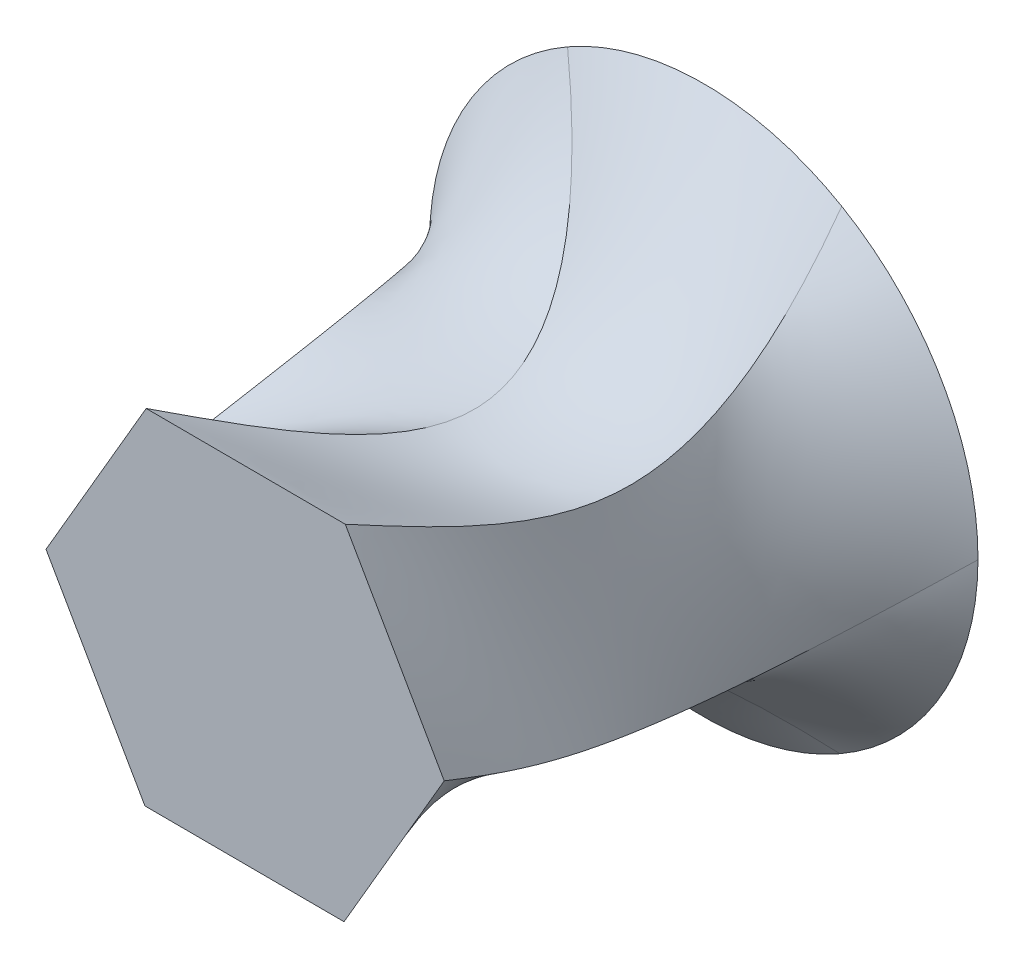
ISO-10303-21;
HEADER;
FILE_DESCRIPTION(('STEP AP214'),'2;1');
FILE_NAME('part.step','',(''),(''),'','','');
FILE_SCHEMA(('AUTOMOTIVE_DESIGN { 1 0 10303 214 1 1 1 1 }'));
ENDSEC;
DATA;
#1=APPLICATION_CONTEXT('core data for automotive mechanical design processes');
#2=APPLICATION_PROTOCOL_DEFINITION('international standard','automotive_design',2000,#1);
#3=PRODUCT_CONTEXT('',#1,'mechanical');
#4=PRODUCT('Part','Part','',(#3));
#5=PRODUCT_RELATED_PRODUCT_CATEGORY('part','',(#4));
#6=PRODUCT_DEFINITION_FORMATION('','',#4);
#7=PRODUCT_DEFINITION_CONTEXT('part definition',#1,'design');
#8=PRODUCT_DEFINITION('design','',#6,#7);
#9=PRODUCT_DEFINITION_SHAPE('','',#8);
#10=(LENGTH_UNIT() NAMED_UNIT(*) SI_UNIT(.MILLI.,.METRE.));
#11=(NAMED_UNIT(*) PLANE_ANGLE_UNIT() SI_UNIT($,.RADIAN.));
#12=(NAMED_UNIT(*) SI_UNIT($,.STERADIAN.) SOLID_ANGLE_UNIT());
#13=UNCERTAINTY_MEASURE_WITH_UNIT(LENGTH_MEASURE(1.E-05),#10,'distance_accuracy_value','');
#14=(GEOMETRIC_REPRESENTATION_CONTEXT(3) GLOBAL_UNCERTAINTY_ASSIGNED_CONTEXT((#13)) GLOBAL_UNIT_ASSIGNED_CONTEXT((#10,
#11,#12)) REPRESENTATION_CONTEXT('',''));
#15=CARTESIAN_POINT('',(0.,0.,0.));
#16=DIRECTION('',(0.,0.,1.));
#17=DIRECTION('',(1.,0.,0.));
#18=AXIS2_PLACEMENT_3D('',#15,#16,#17);
#19=CARTESIAN_POINT('',(0.,0.,76.2));
#20=DIRECTION('',(0.,0.,1.));
#21=DIRECTION('',(1.,0.,0.));
#22=AXIS2_PLACEMENT_3D('',#19,#20,#21);
#23=PLANE('',#22);
#24=DIRECTION('',(0.999993184885984,-0.00369190758095089,0.));
#25=VECTOR('',#24,1.);
#26=CARTESIAN_POINT('',(-11.0964684453954,-19.0568186964882,76.2));
#27=LINE('',#26,#25);
#28=CARTESIAN_POINT('',(-11.0964684453954,-19.0568186964882,76.2));
#29=VERTEX_POINT('',#28);
#30=CARTESIAN_POINT('',(10.9554548837754,-19.1382329142489,76.2));
#31=VERTEX_POINT('',#30);
#32=EDGE_CURVE('E136',#29,#31,#27,.T.);
#33=ORIENTED_EDGE('',*,*,#32,.T.);
#34=DIRECTION('',(0.503193878196519,0.864173547932096,0.));
#35=VECTOR('',#34,1.);
#36=CARTESIAN_POINT('',(10.9554548837754,-19.1382329142489,76.2));
#37=LINE('',#36,#35);
#38=CARTESIAN_POINT('',(22.0519233291708,-0.0814142177606829,76.2));
#39=VERTEX_POINT('',#38);
#40=EDGE_CURVE('E151',#31,#39,#37,.T.);
#41=ORIENTED_EDGE('',*,*,#40,.T.);
#42=DIRECTION('',(-0.496799306689465,0.867865455513046,0.));
#43=VECTOR('',#42,1.);
#44=CARTESIAN_POINT('',(22.0519233291708,-0.0814142177606795,76.2));
#45=LINE('',#44,#43);
#46=CARTESIAN_POINT('',(11.0964684453954,19.0568186964882,76.2));
#47=VERTEX_POINT('',#46);
#48=EDGE_CURVE('E302',#39,#47,#45,.T.);
#49=ORIENTED_EDGE('',*,*,#48,.T.);
#50=DIRECTION('',(-0.999993184885984,0.00369190758095073,0.));
#51=VECTOR('',#50,1.);
#52=CARTESIAN_POINT('',(11.0964684453954,19.0568186964882,76.2));
#53=LINE('',#52,#51);
#54=CARTESIAN_POINT('',(-10.9554548837754,19.1382329142489,76.2));
#55=VERTEX_POINT('',#54);
#56=EDGE_CURVE('E431',#47,#55,#53,.T.);
#57=ORIENTED_EDGE('',*,*,#56,.T.);
#58=DIRECTION('',(-0.503193878196519,-0.864173547932096,0.));
#59=VECTOR('',#58,1.);
#60=CARTESIAN_POINT('',(-10.9554548837754,19.1382329142489,76.2));
#61=LINE('',#60,#59);
#62=CARTESIAN_POINT('',(-22.0519233291708,0.0814142177606898,76.2));
#63=VERTEX_POINT('',#62);
#64=EDGE_CURVE('E138',#55,#63,#61,.T.);
#65=ORIENTED_EDGE('',*,*,#64,.T.);
#66=DIRECTION('',(0.496799306689464,-0.867865455513047,0.));
#67=VECTOR('',#66,1.);
#68=CARTESIAN_POINT('',(-22.0519233291708,0.0814142177606898,76.2));
#69=LINE('',#68,#67);
#70=EDGE_CURVE('E132',#63,#29,#69,.T.);
#71=ORIENTED_EDGE('',*,*,#70,.T.);
#72=EDGE_LOOP('',(#33,#41,#49,#57,#65,#71));
#73=FACE_BOUND('',#72,.T.);
#74=ADVANCED_FACE('F77',(#73),#23,.T.);
#75=CARTESIAN_POINT('',(0.,0.,25.4));
#76=DIRECTION('',(0.,0.,1.));
#77=DIRECTION('',(1.,0.,0.));
#78=AXIS2_PLACEMENT_3D('',#75,#76,#77);
#79=PLANE('',#78);
#80=CARTESIAN_POINT('',(0.,0.,25.4));
#81=DIRECTION('',(0.,0.,1.));
#82=DIRECTION('',(1.,0.,0.));
#83=AXIS2_PLACEMENT_3D('',#80,#81,#82);
#84=CIRCLE('',#83,30.3709392811349);
#85=CARTESIAN_POINT('',(-15.2824707213453,-26.2457623526086,25.4));
#86=VERTEX_POINT('',#85);
#87=CARTESIAN_POINT('',(15.0882615783756,-26.3578890535812,25.4));
#88=VERTEX_POINT('',#87);
#89=EDGE_CURVE('E12',#86,#88,#84,.T.);
#90=ORIENTED_EDGE('',*,*,#89,.F.);
#91=CARTESIAN_POINT('',(-30.3707322997209,0.112126700972625,25.4));
#92=VERTEX_POINT('',#91);
#93=EDGE_CURVE('E158',#92,#86,#84,.T.);
#94=ORIENTED_EDGE('',*,*,#93,.F.);
#95=CARTESIAN_POINT('',(-15.0882615783756,26.3578890535812,25.4));
#96=VERTEX_POINT('',#95);
#97=EDGE_CURVE('E272',#96,#92,#84,.T.);
#98=ORIENTED_EDGE('',*,*,#97,.F.);
#99=CARTESIAN_POINT('',(15.2824707213453,26.2457623526086,25.4));
#100=VERTEX_POINT('',#99);
#101=EDGE_CURVE('E279',#100,#96,#84,.T.);
#102=ORIENTED_EDGE('',*,*,#101,.F.);
#103=CARTESIAN_POINT('',(30.3707322997209,-0.112126700972614,25.4));
#104=VERTEX_POINT('',#103);
#105=EDGE_CURVE('E286',#104,#100,#84,.T.);
#106=ORIENTED_EDGE('',*,*,#105,.F.);
#107=EDGE_CURVE('E88',#88,#104,#84,.T.);
#108=ORIENTED_EDGE('',*,*,#107,.F.);
#109=EDGE_LOOP('',(#90,#94,#98,#102,#106,#108));
#110=FACE_BOUND('',#109,.T.);
#111=ADVANCED_FACE('F234',(#110),#79,.F.);
#112=CARTESIAN_POINT('',(-15.2824707213453,-26.2457623526086,25.4));
#113=CARTESIAN_POINT('',(-16.4058980942948,-17.8948094901852,33.4412881536055));
#114=CARTESIAN_POINT('',(-17.2381273575174,-7.2056502706324,48.8919095404912));
#115=CARTESIAN_POINT('',(-13.0523822065351,-15.2826163610305,67.5032829265754));
#116=CARTESIAN_POINT('',(-11.0964684453954,-19.0568186964882,76.2));
#117=CARTESIAN_POINT('',(-5.90713191478296,-31.7048661457869,25.4));
#118=CARTESIAN_POINT('',(-9.75644648714723,-23.3507871847584,33.3005684604172));
#119=CARTESIAN_POINT('',(-13.1311209477554,-5.17149749705754,48.9441439380347));
#120=CARTESIAN_POINT('',(-6.73473069075384,-14.6533019686715,67.5199178420635));
#121=CARTESIAN_POINT('',(-3.74582733567179,-19.0839567690751,76.2));
#122=CARTESIAN_POINT('',(5.67286960830608,-31.7476187325611,25.4));
#123=CARTESIAN_POINT('',(-0.902332163472931,-23.3904136729276,33.1598487672289));
#124=CARTESIAN_POINT('',(-9.84247354784639,-5.14786532468922,48.9963783355782));
#125=CARTESIAN_POINT('',(-0.67769925691249,-14.664271409593,67.5365527575517));
#126=CARTESIAN_POINT('',(3.6048137740518,-19.111094841662,76.2));
#127=CARTESIAN_POINT('',(15.0882615783756,-26.3578890535812,25.4));
#128=CARTESIAN_POINT('',(5.78717260718188,-17.9975578953426,33.0191290740406));
#129=CARTESIAN_POINT('',(-5.75033465817422,-7.14074151648945,49.0486127331217));
#130=CARTESIAN_POINT('',(5.63521744901465,-15.317431586823,67.5531876730398));
#131=CARTESIAN_POINT('',(10.9554548837754,-19.1382329142489,76.2));
#132=B_SPLINE_SURFACE_WITH_KNOTS('',3,3,((#112,#113,#114,#115,#116),(#117,#118,#119,#120,#121),
(#122,#123,#124,#125,#126),(#127,#128,#129,#130,#131)),.UNSPECIFIED.,.F.,.F.,.F.,(4,4),(4,1,4),
(0.,1.),(0.,0.5327202945739,1.),.UNSPECIFIED.);
#133=CARTESIAN_POINT('',(15.0882615783756,-26.3578890535812,25.4));
#134=CARTESIAN_POINT('',(5.78717260718188,-17.9975578953426,33.0191290740406));
#135=CARTESIAN_POINT('',(-5.75033465817422,-7.14074151648945,49.0486127331217));
#136=CARTESIAN_POINT('',(5.63521744901465,-15.317431586823,67.5531876730398));
#137=CARTESIAN_POINT('',(10.9554548837754,-19.1382329142489,76.2));
#138=B_SPLINE_CURVE_WITH_KNOTS('',3,(#133,#134,#135,#136,#137),.UNSPECIFIED.,.F.,.F.,(4,1,4),
(0.,0.5327202945739,1.),.UNSPECIFIED.);
#139=EDGE_CURVE('E97',#88,#31,#138,.T.);
#140=CARTESIAN_POINT('',(-15.2824707213453,-26.2457623526086,25.4));
#141=CARTESIAN_POINT('',(-16.4058980942948,-17.8948094901852,33.4412881536055));
#142=CARTESIAN_POINT('',(-17.2381273575174,-7.2056502706324,48.8919095404912));
#143=CARTESIAN_POINT('',(-13.0523822065351,-15.2826163610305,67.5032829265754));
#144=CARTESIAN_POINT('',(-11.0964684453954,-19.0568186964882,76.2));
#145=B_SPLINE_CURVE_WITH_KNOTS('',3,(#140,#141,#142,#143,#144),.UNSPECIFIED.,.F.,.F.,(4,1,4),
(0.,0.5327202945739,1.),.UNSPECIFIED.);
#146=EDGE_CURVE('E150',#29,#86,#145,.F.);
#147=ORIENTED_EDGE('',*,*,#89,.T.);
#148=ORIENTED_EDGE('',*,*,#139,.T.);
#149=ORIENTED_EDGE('',*,*,#32,.F.);
#150=ORIENTED_EDGE('',*,*,#146,.T.);
#151=EDGE_LOOP('',(#147,#148,#149,#150));
#152=FACE_BOUND('',#151,.T.);
#153=ADVANCED_FACE('F149',(#152),#132,.T.);
#154=CARTESIAN_POINT('',(15.0882615783756,-26.3578890535812,25.4));
#155=CARTESIAN_POINT('',(5.78717260718187,-17.9975578953426,33.0191290740406));
#156=CARTESIAN_POINT('',(-5.75033465817422,-7.14074151648945,49.0486127331217));
#157=CARTESIAN_POINT('',(5.63521744901465,-15.317431586823,67.5531876730398));
#158=CARTESIAN_POINT('',(10.9554548837754,-19.1382329142489,76.2));
#159=CARTESIAN_POINT('',(24.5036535484452,-20.9681593746013,25.4));
#160=CARTESIAN_POINT('',(15.5722592096874,-18.0007939711758,33.1191356751175));
#161=CARTESIAN_POINT('',(-1.60653681061735,-9.22817550005062,49.0114908176366));
#162=CARTESIAN_POINT('',(9.47574998813747,-11.6529241708132,67.5413655796322));
#163=CARTESIAN_POINT('',(14.6542776989072,-12.7859600154195,76.2));
#164=CARTESIAN_POINT('',(30.3306791362137,-10.9609601731308,25.4));
#165=CARTESIAN_POINT('',(21.768979429892,-13.3865605245185,33.2191422761944));
#166=CARTESIAN_POINT('',(3.86924344748987,-13.0295894761637,48.9743689021515));
#167=CARTESIAN_POINT('',(13.7404745515437,-8.53426228314009,67.5295434862245));
#168=CARTESIAN_POINT('',(18.353100514039,-6.4336871165901,76.2));
#169=CARTESIAN_POINT('',(30.3707322997209,-0.112126700972614,25.4));
#170=CARTESIAN_POINT('',(22.1787272258353,-7.93069280717341,33.3191488772713));
#171=CARTESIAN_POINT('',(11.4931169207924,-17.1434135925014,48.9372469866664));
#172=CARTESIAN_POINT('',(18.689295242711,-5.51509261754055,67.5177213928168));
#173=CARTESIAN_POINT('',(22.0519233291708,-0.0814142177606829,76.2));
#174=B_SPLINE_SURFACE_WITH_KNOTS('',3,3,((#154,#155,#156,#157,#158),(#159,#160,#161,#162,#163),
(#164,#165,#166,#167,#168),(#169,#170,#171,#172,#173)),.UNSPECIFIED.,.F.,.F.,.F.,(4,4),(4,1,4),
(0.,1.),(0.,0.5327202945739,1.),.UNSPECIFIED.);
#175=CARTESIAN_POINT('',(30.3707322997209,-0.112126700972614,25.4));
#176=CARTESIAN_POINT('',(22.1787272258353,-7.93069280717341,33.3191488772713));
#177=CARTESIAN_POINT('',(11.4931169207924,-17.1434135925014,48.9372469866664));
#178=CARTESIAN_POINT('',(18.689295242711,-5.51509261754055,67.5177213928168));
#179=CARTESIAN_POINT('',(22.0519233291708,-0.0814142177606829,76.2));
#180=B_SPLINE_CURVE_WITH_KNOTS('',3,(#175,#176,#177,#178,#179),.UNSPECIFIED.,.F.,.F.,(4,1,4),
(0.,0.5327202945739,1.),.UNSPECIFIED.);
#181=EDGE_CURVE('E160',#104,#39,#180,.T.);
#182=ORIENTED_EDGE('',*,*,#107,.T.);
#183=ORIENTED_EDGE('',*,*,#181,.T.);
#184=ORIENTED_EDGE('',*,*,#40,.F.);
#185=ORIENTED_EDGE('',*,*,#139,.F.);
#186=EDGE_LOOP('',(#182,#183,#184,#185));
#187=FACE_BOUND('',#186,.T.);
#188=ADVANCED_FACE('F202',(#187),#174,.T.);
#189=CARTESIAN_POINT('',(-30.3707322997209,0.112126700972624,25.4));
#190=CARTESIAN_POINT('',(-22.1787272258352,7.93069280717342,33.3191488772713));
#191=CARTESIAN_POINT('',(-11.4931169207924,17.1434135925014,48.9372469866664));
#192=CARTESIAN_POINT('',(-18.689295242711,5.51509261754055,67.5177213928168));
#193=CARTESIAN_POINT('',(-22.0519233291708,0.0814142177606898,76.2));
#194=CARTESIAN_POINT('',(-30.4107854632281,-10.7367067711856,25.4));
#195=CARTESIAN_POINT('',(-25.3239245382875,-2.74067841291058,33.3598619693827));
#196=CARTESIAN_POINT('',(-11.5263588776211,9.79278545187455,48.922134504608));
#197=CARTESIAN_POINT('',(-16.2110458746117,-1.17361866727558,67.5129085707364));
#198=CARTESIAN_POINT('',(-18.400105034579,-6.29799675365562,76.2));
#199=CARTESIAN_POINT('',(-24.6578095279076,-20.7866585594303,25.4));
#200=CARTESIAN_POINT('',(-22.6760927519121,-12.6131679490811,33.4005750614941));
#201=CARTESIAN_POINT('',(-13.7099422548532,2.14561670259298,48.9070220225496));
#202=CARTESIAN_POINT('',(-14.4176086127358,-7.95676825703562,67.5080957486559));
#203=CARTESIAN_POINT('',(-14.7482867399872,-12.6774077250719,76.2));
#204=CARTESIAN_POINT('',(-15.2824707213453,-26.2457623526086,25.4));
#205=CARTESIAN_POINT('',(-16.4058980942948,-17.8948094901852,33.4412881536055));
#206=CARTESIAN_POINT('',(-17.2381273575174,-7.20565027063239,48.8919095404912));
#207=CARTESIAN_POINT('',(-13.0523822065351,-15.2826163610304,67.5032829265754));
#208=CARTESIAN_POINT('',(-11.0964684453954,-19.0568186964882,76.2));
#209=B_SPLINE_SURFACE_WITH_KNOTS('',3,3,((#189,#190,#191,#192,#193),(#194,#195,#196,#197,#198),
(#199,#200,#201,#202,#203),(#204,#205,#206,#207,#208)),.UNSPECIFIED.,.F.,.F.,.F.,(4,4),(4,1,4),
(0.,1.),(0.,0.5327202945739,1.),.UNSPECIFIED.);
#210=CARTESIAN_POINT('',(-30.3707322997209,0.112126700972625,25.4));
#211=CARTESIAN_POINT('',(-22.1787272258353,7.93069280717342,33.3191488772713));
#212=CARTESIAN_POINT('',(-11.4931169207924,17.1434135925014,48.9372469866664));
#213=CARTESIAN_POINT('',(-18.689295242711,5.51509261754055,67.5177213928168));
#214=CARTESIAN_POINT('',(-22.0519233291708,0.0814142177606898,76.2));
#215=B_SPLINE_CURVE_WITH_KNOTS('',3,(#210,#211,#212,#213,#214),.UNSPECIFIED.,.F.,.F.,(4,1,4),
(0.,0.5327202945739,1.),.UNSPECIFIED.);
#216=EDGE_CURVE('E126',#92,#63,#215,.T.);
#217=ORIENTED_EDGE('',*,*,#93,.T.);
#218=ORIENTED_EDGE('',*,*,#146,.F.);
#219=ORIENTED_EDGE('',*,*,#70,.F.);
#220=ORIENTED_EDGE('',*,*,#216,.F.);
#221=EDGE_LOOP('',(#217,#218,#219,#220));
#222=FACE_BOUND('',#221,.T.);
#223=ADVANCED_FACE('F156',(#222),#209,.T.);
#224=CARTESIAN_POINT('',(30.3707322997209,-0.112126700972614,25.4));
#225=CARTESIAN_POINT('',(22.1787272258353,-7.93069280717341,33.3191488772713));
#226=CARTESIAN_POINT('',(11.4931169207924,-17.1434135925014,48.9372469866664));
#227=CARTESIAN_POINT('',(18.689295242711,-5.51509261754055,67.5177213928168));
#228=CARTESIAN_POINT('',(22.0519233291708,-0.0814142177606795,76.2));
#229=CARTESIAN_POINT('',(30.4107854632281,10.7367067711856,25.4));
#230=CARTESIAN_POINT('',(25.3239245382875,2.74067841291059,33.3598619693827));
#231=CARTESIAN_POINT('',(11.5263588776211,-9.79278545187455,48.922134504608));
#232=CARTESIAN_POINT('',(16.2110458746117,1.17361866727559,67.5129085707364));
#233=CARTESIAN_POINT('',(18.400105034579,6.29799675365563,76.2));
#234=CARTESIAN_POINT('',(24.6578095279076,20.7866585594303,25.4));
#235=CARTESIAN_POINT('',(22.6760927519121,12.6131679490811,33.4005750614941));
#236=CARTESIAN_POINT('',(13.7099422548532,-2.14561670259297,48.9070220225496));
#237=CARTESIAN_POINT('',(14.4176086127358,7.95676825703563,67.5080957486559));
#238=CARTESIAN_POINT('',(14.7482867399872,12.6774077250719,76.2));
#239=CARTESIAN_POINT('',(15.2824707213453,26.2457623526086,25.4));
#240=CARTESIAN_POINT('',(16.4058980942948,17.8948094901852,33.4412881536055));
#241=CARTESIAN_POINT('',(17.2381273575174,7.2056502706324,48.8919095404912));
#242=CARTESIAN_POINT('',(13.0523822065351,15.2826163610305,67.5032829265754));
#243=CARTESIAN_POINT('',(11.0964684453954,19.0568186964882,76.2));
#244=B_SPLINE_SURFACE_WITH_KNOTS('',3,3,((#224,#225,#226,#227,#228),(#229,#230,#231,#232,#233),
(#234,#235,#236,#237,#238),(#239,#240,#241,#242,#243)),.UNSPECIFIED.,.F.,.F.,.F.,(4,4),(4,1,4),
(0.,1.),(0.,0.5327202945739,1.),.UNSPECIFIED.);
#245=CARTESIAN_POINT('',(15.2824707213453,26.2457623526086,25.4));
#246=CARTESIAN_POINT('',(16.4058980942948,17.8948094901852,33.4412881536055));
#247=CARTESIAN_POINT('',(17.2381273575174,7.2056502706324,48.8919095404912));
#248=CARTESIAN_POINT('',(13.0523822065351,15.2826163610305,67.5032829265754));
#249=CARTESIAN_POINT('',(11.0964684453954,19.0568186964882,76.2));
#250=B_SPLINE_CURVE_WITH_KNOTS('',3,(#245,#246,#247,#248,#249),.UNSPECIFIED.,.F.,.F.,(4,1,4),
(0.,0.5327202945739,1.),.UNSPECIFIED.);
#251=EDGE_CURVE('E164',#100,#47,#250,.T.);
#252=ORIENTED_EDGE('',*,*,#105,.T.);
#253=ORIENTED_EDGE('',*,*,#251,.T.);
#254=ORIENTED_EDGE('',*,*,#48,.F.);
#255=ORIENTED_EDGE('',*,*,#181,.F.);
#256=EDGE_LOOP('',(#252,#253,#254,#255));
#257=FACE_BOUND('',#256,.T.);
#258=ADVANCED_FACE('F201',(#257),#244,.T.);
#259=CARTESIAN_POINT('',(15.2824707213453,26.2457623526086,25.4));
#260=CARTESIAN_POINT('',(16.4058980942948,17.8948094901852,33.4412881536055));
#261=CARTESIAN_POINT('',(17.2381273575174,7.2056502706324,48.8919095404912));
#262=CARTESIAN_POINT('',(13.0523822065351,15.2826163610305,67.5032829265754));
#263=CARTESIAN_POINT('',(11.0964684453954,19.0568186964882,76.2));
#264=CARTESIAN_POINT('',(5.90713191478295,31.7048661457869,25.4));
#265=CARTESIAN_POINT('',(9.75644648714723,23.3507871847584,33.3005684604172));
#266=CARTESIAN_POINT('',(13.1311209477554,5.17149749705753,48.9441439380347));
#267=CARTESIAN_POINT('',(6.73473069075383,14.6533019686715,67.5199178420635));
#268=CARTESIAN_POINT('',(3.74582733567178,19.0839567690751,76.2));
#269=CARTESIAN_POINT('',(-5.6728696083061,31.7476187325611,25.4));
#270=CARTESIAN_POINT('',(0.902332163472924,23.3904136729276,33.1598487672289));
#271=CARTESIAN_POINT('',(9.8424735478464,5.14786532468922,48.9963783355782));
#272=CARTESIAN_POINT('',(0.677699256912485,14.664271409593,67.5365527575517));
#273=CARTESIAN_POINT('',(-3.60481377405181,19.111094841662,76.2));
#274=CARTESIAN_POINT('',(-15.0882615783756,26.3578890535812,25.4));
#275=CARTESIAN_POINT('',(-5.78717260718187,17.9975578953426,33.0191290740406));
#276=CARTESIAN_POINT('',(5.75033465817423,7.14074151648945,49.0486127331217));
#277=CARTESIAN_POINT('',(-5.63521744901466,15.317431586823,67.5531876730398));
#278=CARTESIAN_POINT('',(-10.9554548837754,19.1382329142489,76.2));
#279=B_SPLINE_SURFACE_WITH_KNOTS('',3,3,((#259,#260,#261,#262,#263),(#264,#265,#266,#267,#268),
(#269,#270,#271,#272,#273),(#274,#275,#276,#277,#278)),.UNSPECIFIED.,.F.,.F.,.F.,(4,4),(4,1,4),
(0.,1.),(0.,0.5327202945739,1.),.UNSPECIFIED.);
#280=CARTESIAN_POINT('',(-15.0882615783756,26.3578890535812,25.4));
#281=CARTESIAN_POINT('',(-5.78717260718187,17.9975578953426,33.0191290740406));
#282=CARTESIAN_POINT('',(5.75033465817423,7.14074151648945,49.0486127331217));
#283=CARTESIAN_POINT('',(-5.63521744901466,15.317431586823,67.5531876730398));
#284=CARTESIAN_POINT('',(-10.9554548837754,19.1382329142489,76.2));
#285=B_SPLINE_CURVE_WITH_KNOTS('',3,(#280,#281,#282,#283,#284),.UNSPECIFIED.,.F.,.F.,(4,1,4),
(0.,0.5327202945739,1.),.UNSPECIFIED.);
#286=EDGE_CURVE('E306',#96,#55,#285,.T.);
#287=ORIENTED_EDGE('',*,*,#101,.T.);
#288=ORIENTED_EDGE('',*,*,#286,.T.);
#289=ORIENTED_EDGE('',*,*,#56,.F.);
#290=ORIENTED_EDGE('',*,*,#251,.F.);
#291=EDGE_LOOP('',(#287,#288,#289,#290));
#292=FACE_BOUND('',#291,.T.);
#293=ADVANCED_FACE('F333',(#292),#279,.T.);
#294=CARTESIAN_POINT('',(-15.0882615783756,26.3578890535812,25.4));
#295=CARTESIAN_POINT('',(-5.78717260718188,17.9975578953426,33.0191290740406));
#296=CARTESIAN_POINT('',(5.75033465817423,7.14074151648945,49.0486127331217));
#297=CARTESIAN_POINT('',(-5.63521744901466,15.317431586823,67.5531876730398));
#298=CARTESIAN_POINT('',(-10.9554548837754,19.1382329142489,76.2));
#299=CARTESIAN_POINT('',(-24.5036535484452,20.9681593746013,25.4));
#300=CARTESIAN_POINT('',(-15.5722592096874,18.0007939711758,33.1191356751175));
#301=CARTESIAN_POINT('',(1.60653681061735,9.22817550005062,49.0114908176366));
#302=CARTESIAN_POINT('',(-9.47574998813747,11.6529241708132,67.5413655796322));
#303=CARTESIAN_POINT('',(-14.6542776989072,12.7859600154195,76.2));
#304=CARTESIAN_POINT('',(-30.3306791362137,10.9609601731308,25.4));
#305=CARTESIAN_POINT('',(-21.768979429892,13.3865605245185,33.2191422761944));
#306=CARTESIAN_POINT('',(-3.86924344748986,13.0295894761637,48.9743689021515));
#307=CARTESIAN_POINT('',(-13.7404745515437,8.5342622831401,67.5295434862245));
#308=CARTESIAN_POINT('',(-18.353100514039,6.43368711659011,76.2));
#309=CARTESIAN_POINT('',(-30.3707322997209,0.112126700972625,25.4));
#310=CARTESIAN_POINT('',(-22.1787272258353,7.93069280717342,33.3191488772713));
#311=CARTESIAN_POINT('',(-11.4931169207924,17.1434135925014,48.9372469866664));
#312=CARTESIAN_POINT('',(-18.689295242711,5.51509261754055,67.5177213928168));
#313=CARTESIAN_POINT('',(-22.0519233291708,0.0814142177606898,76.2));
#314=B_SPLINE_SURFACE_WITH_KNOTS('',3,3,((#294,#295,#296,#297,#298),(#299,#300,#301,#302,#303),
(#304,#305,#306,#307,#308),(#309,#310,#311,#312,#313)),.UNSPECIFIED.,.F.,.F.,.F.,(4,4),(4,1,4),
(0.,1.),(0.,0.5327202945739,1.),.UNSPECIFIED.);
#315=ORIENTED_EDGE('',*,*,#97,.T.);
#316=ORIENTED_EDGE('',*,*,#216,.T.);
#317=ORIENTED_EDGE('',*,*,#64,.F.);
#318=ORIENTED_EDGE('',*,*,#286,.F.);
#319=EDGE_LOOP('',(#315,#316,#317,#318));
#320=FACE_BOUND('',#319,.T.);
#321=ADVANCED_FACE('F305',(#320),#314,.T.);
#322=CLOSED_SHELL('',(#74,#111,#153,#188,#223,#258,#293,#321));
#323=MANIFOLD_SOLID_BREP('B2',#322);
#324=ADVANCED_BREP_SHAPE_REPRESENTATION('',(#18,#323),#14);
#325=SHAPE_DEFINITION_REPRESENTATION(#9,#324);
ENDSEC;
END-ISO-10303-21;
